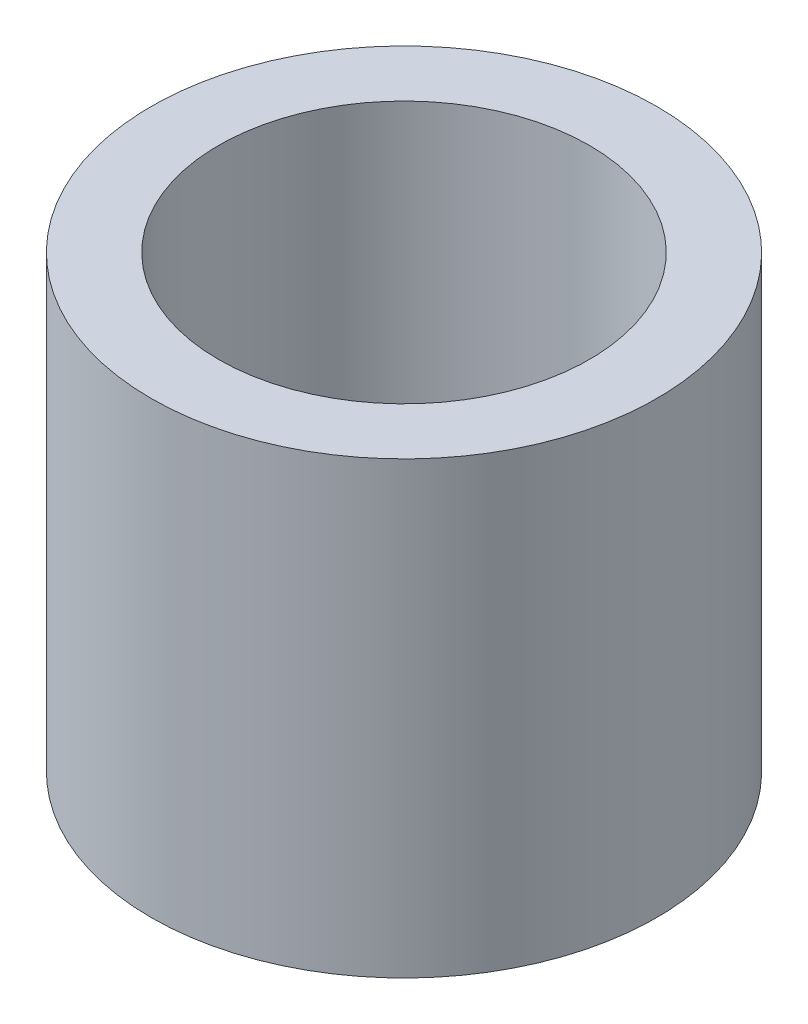
ISO-10303-21;
HEADER;
FILE_DESCRIPTION(('STEP AP214'),'2;1');
FILE_NAME('part.step','',(''),(''),'','','');
FILE_SCHEMA(('AUTOMOTIVE_DESIGN { 1 0 10303 214 1 1 1 1 }'));
ENDSEC;
DATA;
#1=APPLICATION_CONTEXT('core data for automotive mechanical design processes');
#2=APPLICATION_PROTOCOL_DEFINITION('international standard','automotive_design',2000,#1);
#3=PRODUCT_CONTEXT('',#1,'mechanical');
#4=PRODUCT('Part','Part','',(#3));
#5=PRODUCT_RELATED_PRODUCT_CATEGORY('part','',(#4));
#6=PRODUCT_DEFINITION_FORMATION('','',#4);
#7=PRODUCT_DEFINITION_CONTEXT('part definition',#1,'design');
#8=PRODUCT_DEFINITION('design','',#6,#7);
#9=PRODUCT_DEFINITION_SHAPE('','',#8);
#10=(LENGTH_UNIT() NAMED_UNIT(*) SI_UNIT(.MILLI.,.METRE.));
#11=(NAMED_UNIT(*) PLANE_ANGLE_UNIT() SI_UNIT($,.RADIAN.));
#12=(NAMED_UNIT(*) SI_UNIT($,.STERADIAN.) SOLID_ANGLE_UNIT());
#13=UNCERTAINTY_MEASURE_WITH_UNIT(LENGTH_MEASURE(1.E-05),#10,'distance_accuracy_value','');
#14=(GEOMETRIC_REPRESENTATION_CONTEXT(3) GLOBAL_UNCERTAINTY_ASSIGNED_CONTEXT((#13)) GLOBAL_UNIT_ASSIGNED_CONTEXT((#10,
#11,#12)) REPRESENTATION_CONTEXT('',''));
#15=CARTESIAN_POINT('',(0.,0.,0.));
#16=DIRECTION('',(0.,0.,1.));
#17=DIRECTION('',(1.,0.,0.));
#18=AXIS2_PLACEMENT_3D('',#15,#16,#17);
#19=CARTESIAN_POINT('',(0.,5.08,0.));
#20=DIRECTION('',(0.,1.,0.));
#21=DIRECTION('',(0.,0.,1.));
#22=AXIS2_PLACEMENT_3D('',#19,#20,#21);
#23=PLANE('',#22);
#24=CARTESIAN_POINT('',(0.,5.08,0.));
#25=DIRECTION('',(0.,1.,0.));
#26=DIRECTION('',(0.,0.,1.));
#27=AXIS2_PLACEMENT_3D('',#24,#25,#26);
#28=CIRCLE('',#27,5.715);
#29=CARTESIAN_POINT('',(0.,5.08,5.715));
#30=VERTEX_POINT('',#29);
#31=EDGE_CURVE('E10',#30,#30,#28,.T.);
#32=ORIENTED_EDGE('',*,*,#31,.T.);
#33=EDGE_LOOP('',(#32));
#34=FACE_BOUND('',#33,.T.);
#35=CARTESIAN_POINT('',(0.,5.08,0.));
#36=DIRECTION('',(0.,1.,0.));
#37=DIRECTION('',(0.,0.,1.));
#38=AXIS2_PLACEMENT_3D('',#35,#36,#37);
#39=CIRCLE('',#38,4.191);
#40=CARTESIAN_POINT('',(0.,5.08,4.191));
#41=VERTEX_POINT('',#40);
#42=EDGE_CURVE('E44',#41,#41,#39,.T.);
#43=ORIENTED_EDGE('',*,*,#42,.F.);
#44=EDGE_LOOP('',(#43));
#45=FACE_BOUND('',#44,.T.);
#46=ADVANCED_FACE('F33',(#34,#45),#23,.T.);
#47=CARTESIAN_POINT('',(0.,-5.08,0.));
#48=DIRECTION('',(0.,1.,0.));
#49=DIRECTION('',(0.,0.,1.));
#50=AXIS2_PLACEMENT_3D('',#47,#48,#49);
#51=PLANE('',#50);
#52=CARTESIAN_POINT('',(0.,-5.08,0.));
#53=DIRECTION('',(0.,1.,0.));
#54=DIRECTION('',(0.,0.,1.));
#55=AXIS2_PLACEMENT_3D('',#52,#53,#54);
#56=CIRCLE('',#55,5.715);
#57=CARTESIAN_POINT('',(0.,-5.08,5.715));
#58=VERTEX_POINT('',#57);
#59=EDGE_CURVE('E37',#58,#58,#56,.T.);
#60=ORIENTED_EDGE('',*,*,#59,.F.);
#61=EDGE_LOOP('',(#60));
#62=FACE_BOUND('',#61,.T.);
#63=CARTESIAN_POINT('',(0.,-5.08,0.));
#64=DIRECTION('',(0.,1.,0.));
#65=DIRECTION('',(0.,0.,1.));
#66=AXIS2_PLACEMENT_3D('',#63,#64,#65);
#67=CIRCLE('',#66,4.191);
#68=CARTESIAN_POINT('',(0.,-5.08,4.191));
#69=VERTEX_POINT('',#68);
#70=EDGE_CURVE('E46',#69,#69,#67,.T.);
#71=ORIENTED_EDGE('',*,*,#70,.T.);
#72=EDGE_LOOP('',(#71));
#73=FACE_BOUND('',#72,.T.);
#74=ADVANCED_FACE('F56',(#62,#73),#51,.F.);
#75=CARTESIAN_POINT('',(0.,5.08,0.));
#76=DIRECTION('',(0.,-1.,0.));
#77=DIRECTION('',(0.,0.,-1.));
#78=AXIS2_PLACEMENT_3D('',#75,#76,#77);
#79=CYLINDRICAL_SURFACE('',#78,5.715);
#80=ORIENTED_EDGE('',*,*,#31,.F.);
#81=EDGE_LOOP('',(#80));
#82=FACE_BOUND('',#81,.T.);
#83=ORIENTED_EDGE('',*,*,#59,.T.);
#84=EDGE_LOOP('',(#83));
#85=FACE_BOUND('',#84,.T.);
#86=ADVANCED_FACE('F35',(#82,#85),#79,.T.);
#87=CARTESIAN_POINT('',(0.,5.08,0.));
#88=DIRECTION('',(0.,-1.,0.));
#89=DIRECTION('',(0.,0.,-1.));
#90=AXIS2_PLACEMENT_3D('',#87,#88,#89);
#91=CYLINDRICAL_SURFACE('',#90,4.191);
#92=ORIENTED_EDGE('',*,*,#42,.T.);
#93=EDGE_LOOP('',(#92));
#94=FACE_BOUND('',#93,.T.);
#95=ORIENTED_EDGE('',*,*,#70,.F.);
#96=EDGE_LOOP('',(#95));
#97=FACE_BOUND('',#96,.T.);
#98=ADVANCED_FACE('F52',(#94,#97),#91,.F.);
#99=CLOSED_SHELL('',(#46,#74,#86,#98));
#100=MANIFOLD_SOLID_BREP('B2',#99);
#101=ADVANCED_BREP_SHAPE_REPRESENTATION('',(#18,#100),#14);
#102=SHAPE_DEFINITION_REPRESENTATION(#9,#101);
ENDSEC;
END-ISO-10303-21;
